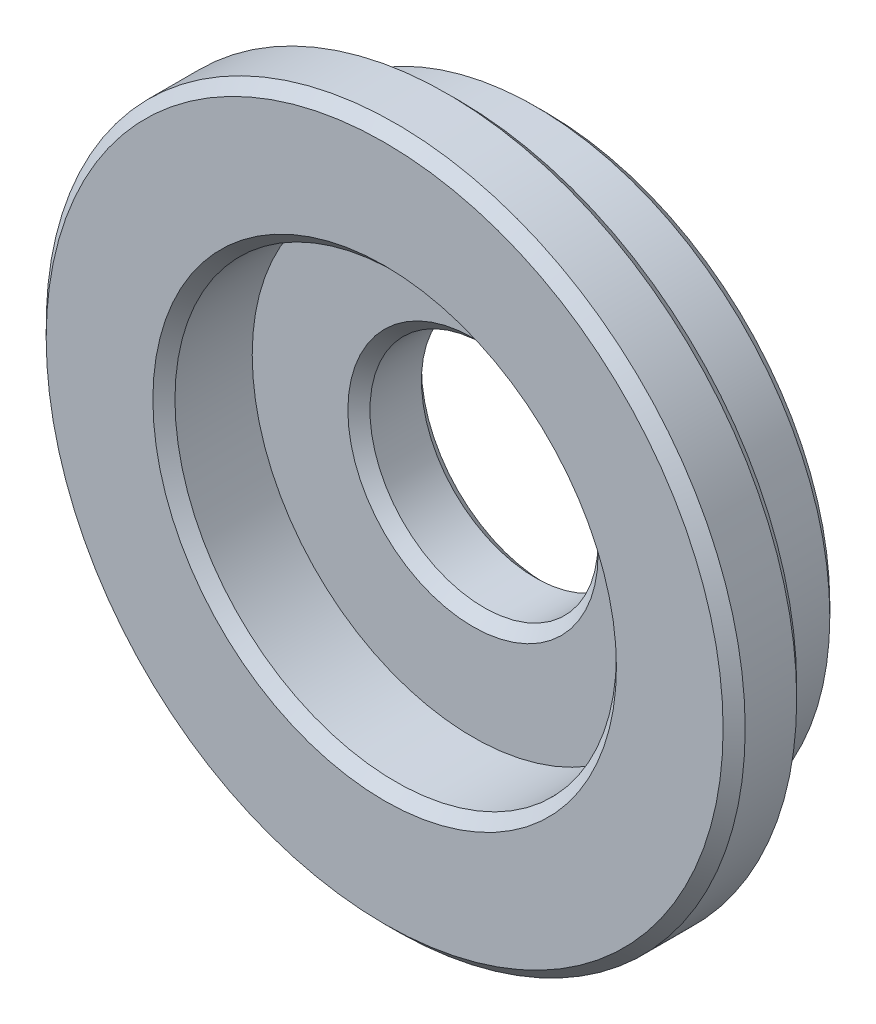
ISO-10303-21;
HEADER;
FILE_DESCRIPTION(('STEP AP214'),'2;1');
FILE_NAME('part.step','',(''),(''),'','','');
FILE_SCHEMA(('AUTOMOTIVE_DESIGN { 1 0 10303 214 1 1 1 1 }'));
ENDSEC;
DATA;
#1=APPLICATION_CONTEXT('core data for automotive mechanical design processes');
#2=APPLICATION_PROTOCOL_DEFINITION('international standard','automotive_design',2000,#1);
#3=PRODUCT_CONTEXT('',#1,'mechanical');
#4=PRODUCT('Part','Part','',(#3));
#5=PRODUCT_RELATED_PRODUCT_CATEGORY('part','',(#4));
#6=PRODUCT_DEFINITION_FORMATION('','',#4);
#7=PRODUCT_DEFINITION_CONTEXT('part definition',#1,'design');
#8=PRODUCT_DEFINITION('design','',#6,#7);
#9=PRODUCT_DEFINITION_SHAPE('','',#8);
#10=(LENGTH_UNIT() NAMED_UNIT(*) SI_UNIT(.MILLI.,.METRE.));
#11=(NAMED_UNIT(*) PLANE_ANGLE_UNIT() SI_UNIT($,.RADIAN.));
#12=(NAMED_UNIT(*) SI_UNIT($,.STERADIAN.) SOLID_ANGLE_UNIT());
#13=UNCERTAINTY_MEASURE_WITH_UNIT(LENGTH_MEASURE(1.E-05),#10,'distance_accuracy_value','');
#14=(GEOMETRIC_REPRESENTATION_CONTEXT(3) GLOBAL_UNCERTAINTY_ASSIGNED_CONTEXT((#13)) GLOBAL_UNIT_ASSIGNED_CONTEXT((#10,
#11,#12)) REPRESENTATION_CONTEXT('',''));
#15=CARTESIAN_POINT('',(0.,0.,0.));
#16=DIRECTION('',(0.,0.,1.));
#17=DIRECTION('',(1.,0.,0.));
#18=AXIS2_PLACEMENT_3D('',#15,#16,#17);
#19=CARTESIAN_POINT('',(0.,0.,0.850000000039108));
#20=DIRECTION('',(0.,0.,1.));
#21=DIRECTION('',(1.,0.,0.));
#22=AXIS2_PLACEMENT_3D('',#19,#20,#21);
#23=CONICAL_SURFACE('',#22,3.0000000000111,0.78539816339745);
#24=CARTESIAN_POINT('',(0.,0.,1.00000000008667));
#25=DIRECTION('',(0.,0.,1.));
#26=DIRECTION('',(1.,0.,0.));
#27=AXIS2_PLACEMENT_3D('',#24,#25,#26);
#28=CIRCLE('',#27,3.15000000005866);
#29=CARTESIAN_POINT('',(3.15000000005866,0.,1.00000000008667));
#30=VERTEX_POINT('',#29);
#31=EDGE_CURVE('E10',#30,#30,#28,.T.);
#32=ORIENTED_EDGE('',*,*,#31,.T.);
#33=EDGE_LOOP('',(#32));
#34=FACE_BOUND('',#33,.T.);
#35=CARTESIAN_POINT('',(0.,0.,0.850000000039108));
#36=DIRECTION('',(0.,0.,1.));
#37=DIRECTION('',(1.,0.,0.));
#38=AXIS2_PLACEMENT_3D('',#35,#36,#37);
#39=CIRCLE('',#38,3.0000000000111);
#40=CARTESIAN_POINT('',(3.0000000000111,0.,0.850000000039108));
#41=VERTEX_POINT('',#40);
#42=EDGE_CURVE('E77',#41,#41,#39,.T.);
#43=ORIENTED_EDGE('',*,*,#42,.F.);
#44=EDGE_LOOP('',(#43));
#45=FACE_BOUND('',#44,.T.);
#46=ADVANCED_FACE('F31',(#34,#45),#23,.F.);
#47=CARTESIAN_POINT('',(3.15000000005866,0.,1.00000000008667));
#48=DIRECTION('',(0.,0.,1.));
#49=DIRECTION('',(1.,0.,0.));
#50=AXIS2_PLACEMENT_3D('',#47,#48,#49);
#51=PLANE('',#50);
#52=CARTESIAN_POINT('',(0.,0.,1.00000000008667));
#53=DIRECTION('',(0.,0.,1.));
#54=DIRECTION('',(1.,0.,0.));
#55=AXIS2_PLACEMENT_3D('',#52,#53,#54);
#56=CIRCLE('',#55,4.59999999992206);
#57=CARTESIAN_POINT('',(4.59999999992206,0.,1.00000000008667));
#58=VERTEX_POINT('',#57);
#59=EDGE_CURVE('E37',#58,#58,#56,.T.);
#60=ORIENTED_EDGE('',*,*,#59,.T.);
#61=EDGE_LOOP('',(#60));
#62=FACE_BOUND('',#61,.T.);
#63=ORIENTED_EDGE('',*,*,#31,.F.);
#64=EDGE_LOOP('',(#63));
#65=FACE_BOUND('',#64,.T.);
#66=ADVANCED_FACE('F85',(#62,#65),#51,.T.);
#67=CARTESIAN_POINT('',(0.,0.,1.00000000008667));
#68=DIRECTION('',(0.,0.,-1.));
#69=DIRECTION('',(-1.,0.,0.));
#70=AXIS2_PLACEMENT_3D('',#67,#68,#69);
#71=CONICAL_SURFACE('',#70,4.59999999992206,0.785398163397447);
#72=CARTESIAN_POINT('',(0.,0.,0.850000000032741));
#73=DIRECTION('',(0.,0.,1.));
#74=DIRECTION('',(1.,0.,0.));
#75=AXIS2_PLACEMENT_3D('',#72,#73,#74);
#76=CIRCLE('',#75,4.74999999997599);
#77=CARTESIAN_POINT('',(4.74999999997599,0.,0.850000000032741));
#78=VERTEX_POINT('',#77);
#79=EDGE_CURVE('E41',#78,#78,#76,.T.);
#80=ORIENTED_EDGE('',*,*,#79,.T.);
#81=EDGE_LOOP('',(#80));
#82=FACE_BOUND('',#81,.T.);
#83=ORIENTED_EDGE('',*,*,#59,.F.);
#84=EDGE_LOOP('',(#83));
#85=FACE_BOUND('',#84,.T.);
#86=ADVANCED_FACE('F89',(#82,#85),#71,.T.);
#87=CARTESIAN_POINT('',(0.,0.,-1.20000000003984));
#88=DIRECTION('',(0.,0.,1.));
#89=DIRECTION('',(1.,0.,0.));
#90=AXIS2_PLACEMENT_3D('',#87,#88,#89);
#91=CYLINDRICAL_SURFACE('',#90,4.74999999997599);
#92=CARTESIAN_POINT('',(0.,0.,0.150000000051932));
#93=DIRECTION('',(0.,0.,1.));
#94=DIRECTION('',(1.,0.,0.));
#95=AXIS2_PLACEMENT_3D('',#92,#93,#94);
#96=CIRCLE('',#95,4.74999999997599);
#97=CARTESIAN_POINT('',(4.74999999997599,0.,0.150000000051932));
#98=VERTEX_POINT('',#97);
#99=EDGE_CURVE('E45',#98,#98,#96,.T.);
#100=ORIENTED_EDGE('',*,*,#99,.T.);
#101=EDGE_LOOP('',(#100));
#102=FACE_BOUND('',#101,.T.);
#103=ORIENTED_EDGE('',*,*,#79,.F.);
#104=EDGE_LOOP('',(#103));
#105=FACE_BOUND('',#104,.T.);
#106=ADVANCED_FACE('F93',(#102,#105),#91,.T.);
#107=CARTESIAN_POINT('',(0.,0.,0.150000000051932));
#108=DIRECTION('',(0.,0.,1.));
#109=DIRECTION('',(1.,0.,0.));
#110=AXIS2_PLACEMENT_3D('',#107,#108,#109);
#111=CONICAL_SURFACE('',#110,4.74999999997599,0.785398163397448);
#112=CARTESIAN_POINT('',(0.,0.,3.27418214068897E-11));
#113=DIRECTION('',(0.,0.,1.));
#114=DIRECTION('',(1.,0.,0.));
#115=AXIS2_PLACEMENT_3D('',#112,#113,#114);
#116=CIRCLE('',#115,4.5999999999568);
#117=CARTESIAN_POINT('',(4.5999999999568,0.,3.27418214068897E-11));
#118=VERTEX_POINT('',#117);
#119=EDGE_CURVE('E50',#118,#118,#116,.T.);
#120=ORIENTED_EDGE('',*,*,#119,.T.);
#121=EDGE_LOOP('',(#120));
#122=FACE_BOUND('',#121,.T.);
#123=ORIENTED_EDGE('',*,*,#99,.F.);
#124=EDGE_LOOP('',(#123));
#125=FACE_BOUND('',#124,.T.);
#126=ADVANCED_FACE('F100',(#122,#125),#111,.T.);
#127=CARTESIAN_POINT('',(4.5999999999568,0.,3.27417584953995E-11));
#128=DIRECTION('',(0.,0.,-1.));
#129=DIRECTION('',(-1.,0.,0.));
#130=AXIS2_PLACEMENT_3D('',#127,#128,#129);
#131=PLANE('',#130);
#132=CARTESIAN_POINT('',(0.,0.,3.27418214068897E-11));
#133=DIRECTION('',(0.,0.,1.));
#134=DIRECTION('',(1.,0.,0.));
#135=AXIS2_PLACEMENT_3D('',#132,#133,#134);
#136=CIRCLE('',#135,3.99999999995343);
#137=CARTESIAN_POINT('',(3.99999999995343,0.,3.27418214068897E-11));
#138=VERTEX_POINT('',#137);
#139=EDGE_CURVE('E53',#138,#138,#136,.T.);
#140=ORIENTED_EDGE('',*,*,#139,.T.);
#141=EDGE_LOOP('',(#140));
#142=FACE_BOUND('',#141,.T.);
#143=ORIENTED_EDGE('',*,*,#119,.F.);
#144=EDGE_LOOP('',(#143));
#145=FACE_BOUND('',#144,.T.);
#146=ADVANCED_FACE('F104',(#142,#145),#131,.T.);
#147=CARTESIAN_POINT('',(0.,0.,-1.20000000003984));
#148=DIRECTION('',(0.,0.,1.));
#149=DIRECTION('',(1.,0.,0.));
#150=AXIS2_PLACEMENT_3D('',#147,#148,#149);
#151=CYLINDRICAL_SURFACE('',#150,3.99999999995343);
#152=CARTESIAN_POINT('',(0.,0.,-1.05000000007749));
#153=DIRECTION('',(0.,0.,1.));
#154=DIRECTION('',(1.,0.,0.));
#155=AXIS2_PLACEMENT_3D('',#152,#153,#154);
#156=CIRCLE('',#155,3.99999999995343);
#157=CARTESIAN_POINT('',(3.99999999995343,0.,-1.05000000007749));
#158=VERTEX_POINT('',#157);
#159=EDGE_CURVE('E56',#158,#158,#156,.T.);
#160=ORIENTED_EDGE('',*,*,#159,.T.);
#161=EDGE_LOOP('',(#160));
#162=FACE_BOUND('',#161,.T.);
#163=ORIENTED_EDGE('',*,*,#139,.F.);
#164=EDGE_LOOP('',(#163));
#165=FACE_BOUND('',#164,.T.);
#166=ADVANCED_FACE('F108',(#162,#165),#151,.T.);
#167=CARTESIAN_POINT('',(0.,0.,-1.05000000007749));
#168=DIRECTION('',(0.,0.,1.));
#169=DIRECTION('',(1.,0.,0.));
#170=AXIS2_PLACEMENT_3D('',#167,#168,#169);
#171=CONICAL_SURFACE('',#170,3.99999999995343,0.785398163397449);
#172=CARTESIAN_POINT('',(0.,0.,-1.20000000003984));
#173=DIRECTION('',(0.,0.,1.));
#174=DIRECTION('',(1.,0.,0.));
#175=AXIS2_PLACEMENT_3D('',#172,#173,#174);
#176=CIRCLE('',#175,3.84999999999109);
#177=CARTESIAN_POINT('',(3.84999999999109,0.,-1.20000000003984));
#178=VERTEX_POINT('',#177);
#179=EDGE_CURVE('E59',#178,#178,#176,.T.);
#180=ORIENTED_EDGE('',*,*,#179,.T.);
#181=EDGE_LOOP('',(#180));
#182=FACE_BOUND('',#181,.T.);
#183=ORIENTED_EDGE('',*,*,#159,.F.);
#184=EDGE_LOOP('',(#183));
#185=FACE_BOUND('',#184,.T.);
#186=ADVANCED_FACE('F112',(#182,#185),#171,.T.);
#187=CARTESIAN_POINT('',(3.84999999999109,0.,-1.20000000003984));
#188=DIRECTION('',(0.,0.,-1.));
#189=DIRECTION('',(-1.,0.,0.));
#190=AXIS2_PLACEMENT_3D('',#187,#188,#189);
#191=PLANE('',#190);
#192=CARTESIAN_POINT('',(0.,0.,-1.20000000003984));
#193=DIRECTION('',(0.,0.,1.));
#194=DIRECTION('',(1.,0.,0.));
#195=AXIS2_PLACEMENT_3D('',#192,#193,#194);
#196=CIRCLE('',#195,1.70000000001919);
#197=CARTESIAN_POINT('',(1.70000000001919,0.,-1.20000000003984));
#198=VERTEX_POINT('',#197);
#199=EDGE_CURVE('E62',#198,#198,#196,.T.);
#200=ORIENTED_EDGE('',*,*,#199,.T.);
#201=EDGE_LOOP('',(#200));
#202=FACE_BOUND('',#201,.T.);
#203=ORIENTED_EDGE('',*,*,#179,.F.);
#204=EDGE_LOOP('',(#203));
#205=FACE_BOUND('',#204,.T.);
#206=ADVANCED_FACE('F116',(#202,#205),#191,.T.);
#207=CARTESIAN_POINT('',(0.,0.,-1.20000000003984));
#208=DIRECTION('',(0.,0.,-1.));
#209=DIRECTION('',(-1.,0.,0.));
#210=AXIS2_PLACEMENT_3D('',#207,#208,#209);
#211=CONICAL_SURFACE('',#210,1.70000000001919,0.785398163397448);
#212=CARTESIAN_POINT('',(0.,0.,-1.05000000002065));
#213=DIRECTION('',(0.,0.,1.));
#214=DIRECTION('',(1.,0.,0.));
#215=AXIS2_PLACEMENT_3D('',#212,#213,#214);
#216=CIRCLE('',#215,1.55);
#217=CARTESIAN_POINT('',(1.55,0.,-1.05000000002065));
#218=VERTEX_POINT('',#217);
#219=EDGE_CURVE('E65',#218,#218,#216,.T.);
#220=ORIENTED_EDGE('',*,*,#219,.T.);
#221=EDGE_LOOP('',(#220));
#222=FACE_BOUND('',#221,.T.);
#223=ORIENTED_EDGE('',*,*,#199,.F.);
#224=EDGE_LOOP('',(#223));
#225=FACE_BOUND('',#224,.T.);
#226=ADVANCED_FACE('F120',(#222,#225),#211,.F.);
#227=CARTESIAN_POINT('',(0.,0.,-1.20000000003984));
#228=DIRECTION('',(0.,0.,1.));
#229=DIRECTION('',(1.,0.,0.));
#230=AXIS2_PLACEMENT_3D('',#227,#228,#229);
#231=CYLINDRICAL_SURFACE('',#230,1.55);
#232=CARTESIAN_POINT('',(0.,0.,-0.35));
#233=DIRECTION('',(0.,0.,1.));
#234=DIRECTION('',(1.,0.,0.));
#235=AXIS2_PLACEMENT_3D('',#232,#233,#234);
#236=CIRCLE('',#235,1.55);
#237=CARTESIAN_POINT('',(1.55,0.,-0.35));
#238=VERTEX_POINT('',#237);
#239=EDGE_CURVE('E68',#238,#238,#236,.T.);
#240=ORIENTED_EDGE('',*,*,#239,.T.);
#241=EDGE_LOOP('',(#240));
#242=FACE_BOUND('',#241,.T.);
#243=ORIENTED_EDGE('',*,*,#219,.F.);
#244=EDGE_LOOP('',(#243));
#245=FACE_BOUND('',#244,.T.);
#246=ADVANCED_FACE('F124',(#242,#245),#231,.F.);
#247=CARTESIAN_POINT('',(0.,0.,-0.35));
#248=DIRECTION('',(0.,0.,1.));
#249=DIRECTION('',(1.,0.,0.));
#250=AXIS2_PLACEMENT_3D('',#247,#248,#249);
#251=CONICAL_SURFACE('',#250,1.55,0.785398163397448);
#252=CARTESIAN_POINT('',(0.,0.,-0.199999999960892));
#253=DIRECTION('',(0.,0.,1.));
#254=DIRECTION('',(1.,0.,0.));
#255=AXIS2_PLACEMENT_3D('',#252,#253,#254);
#256=CIRCLE('',#255,1.70000000003911);
#257=CARTESIAN_POINT('',(1.70000000003911,0.,-0.199999999960892));
#258=VERTEX_POINT('',#257);
#259=EDGE_CURVE('E71',#258,#258,#256,.T.);
#260=ORIENTED_EDGE('',*,*,#259,.T.);
#261=EDGE_LOOP('',(#260));
#262=FACE_BOUND('',#261,.T.);
#263=ORIENTED_EDGE('',*,*,#239,.F.);
#264=EDGE_LOOP('',(#263));
#265=FACE_BOUND('',#264,.T.);
#266=ADVANCED_FACE('F128',(#262,#265),#251,.F.);
#267=CARTESIAN_POINT('',(1.70000000003911,0.,-0.199999999960892));
#268=DIRECTION('',(0.,0.,1.));
#269=DIRECTION('',(1.,0.,0.));
#270=AXIS2_PLACEMENT_3D('',#267,#268,#269);
#271=PLANE('',#270);
#272=CARTESIAN_POINT('',(0.,0.,-0.199999999960892));
#273=DIRECTION('',(0.,0.,1.));
#274=DIRECTION('',(1.,0.,0.));
#275=AXIS2_PLACEMENT_3D('',#272,#273,#274);
#276=CIRCLE('',#275,3.0000000000111);
#277=CARTESIAN_POINT('',(3.0000000000111,0.,-0.199999999960892));
#278=VERTEX_POINT('',#277);
#279=EDGE_CURVE('E74',#278,#278,#276,.T.);
#280=ORIENTED_EDGE('',*,*,#279,.T.);
#281=EDGE_LOOP('',(#280));
#282=FACE_BOUND('',#281,.T.);
#283=ORIENTED_EDGE('',*,*,#259,.F.);
#284=EDGE_LOOP('',(#283));
#285=FACE_BOUND('',#284,.T.);
#286=ADVANCED_FACE('F132',(#282,#285),#271,.T.);
#287=CARTESIAN_POINT('',(0.,0.,-1.20000000003984));
#288=DIRECTION('',(0.,0.,1.));
#289=DIRECTION('',(1.,0.,0.));
#290=AXIS2_PLACEMENT_3D('',#287,#288,#289);
#291=CYLINDRICAL_SURFACE('',#290,3.0000000000111);
#292=ORIENTED_EDGE('',*,*,#42,.T.);
#293=EDGE_LOOP('',(#292));
#294=FACE_BOUND('',#293,.T.);
#295=ORIENTED_EDGE('',*,*,#279,.F.);
#296=EDGE_LOOP('',(#295));
#297=FACE_BOUND('',#296,.T.);
#298=ADVANCED_FACE('F81',(#294,#297),#291,.F.);
#299=CLOSED_SHELL('',(#46,#66,#86,#106,#126,#146,#166,#186,#206,#226,#246,#266,#286,#298));
#300=MANIFOLD_SOLID_BREP('B2',#299);
#301=ADVANCED_BREP_SHAPE_REPRESENTATION('',(#18,#300),#14);
#302=SHAPE_DEFINITION_REPRESENTATION(#9,#301);
ENDSEC;
END-ISO-10303-21;
